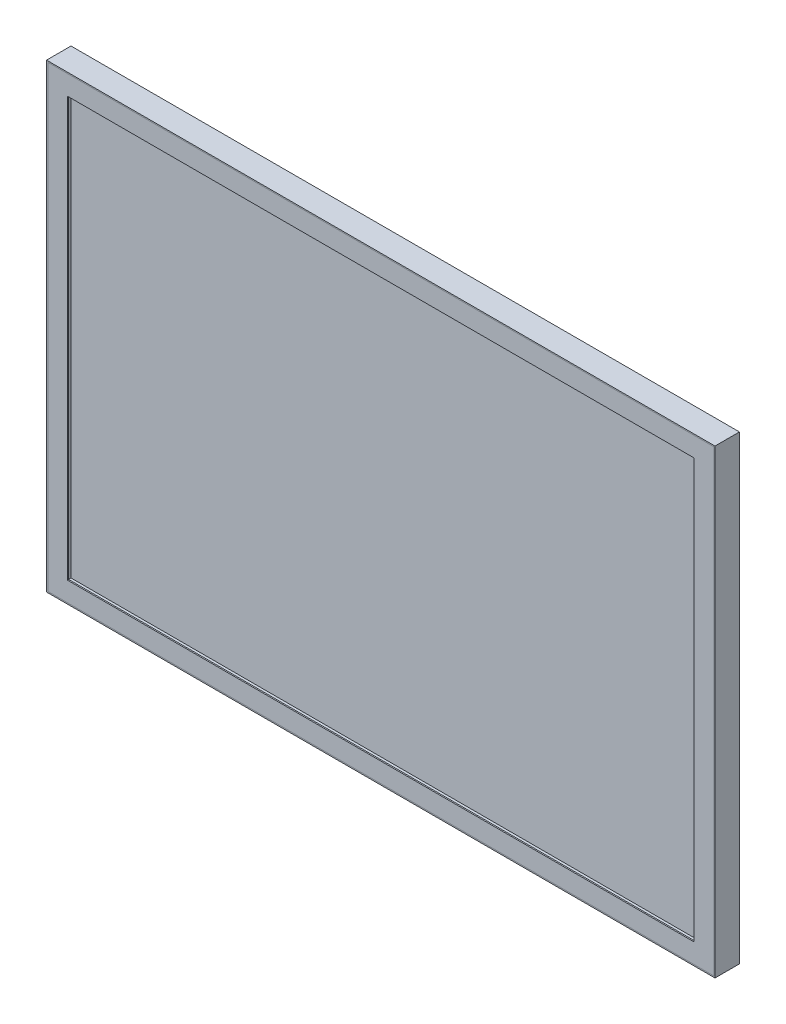
ISO-10303-21;
HEADER;
FILE_DESCRIPTION(('STEP AP214'),'2;1');
FILE_NAME('part.step','',(''),(''),'','','');
FILE_SCHEMA(('AUTOMOTIVE_DESIGN { 1 0 10303 214 1 1 1 1 }'));
ENDSEC;
DATA;
#1=APPLICATION_CONTEXT('core data for automotive mechanical design processes');
#2=APPLICATION_PROTOCOL_DEFINITION('international standard','automotive_design',2000,#1);
#3=PRODUCT_CONTEXT('',#1,'mechanical');
#4=PRODUCT('Part','Part','',(#3));
#5=PRODUCT_RELATED_PRODUCT_CATEGORY('part','',(#4));
#6=PRODUCT_DEFINITION_FORMATION('','',#4);
#7=PRODUCT_DEFINITION_CONTEXT('part definition',#1,'design');
#8=PRODUCT_DEFINITION('design','',#6,#7);
#9=PRODUCT_DEFINITION_SHAPE('','',#8);
#10=(LENGTH_UNIT() NAMED_UNIT(*) SI_UNIT(.MILLI.,.METRE.));
#11=(NAMED_UNIT(*) PLANE_ANGLE_UNIT() SI_UNIT($,.RADIAN.));
#12=(NAMED_UNIT(*) SI_UNIT($,.STERADIAN.) SOLID_ANGLE_UNIT());
#13=UNCERTAINTY_MEASURE_WITH_UNIT(LENGTH_MEASURE(1.E-05),#10,'distance_accuracy_value','');
#14=(GEOMETRIC_REPRESENTATION_CONTEXT(3) GLOBAL_UNCERTAINTY_ASSIGNED_CONTEXT((#13)) GLOBAL_UNIT_ASSIGNED_CONTEXT((#10,
#11,#12)) REPRESENTATION_CONTEXT('',''));
#15=CARTESIAN_POINT('',(0.,0.,0.));
#16=DIRECTION('',(0.,0.,1.));
#17=DIRECTION('',(1.,0.,0.));
#18=AXIS2_PLACEMENT_3D('',#15,#16,#17);
#19=CARTESIAN_POINT('',(-272.5,-187.5,19.));
#20=DIRECTION('',(0.,-1.,0.));
#21=DIRECTION('',(0.,0.,-1.));
#22=AXIS2_PLACEMENT_3D('',#19,#20,#21);
#23=PLANE('',#22);
#24=DIRECTION('',(1.,0.,0.));
#25=VECTOR('',#24,1.);
#26=CARTESIAN_POINT('',(-272.5,-187.5,20.));
#27=LINE('',#26,#25);
#28=CARTESIAN_POINT('',(-272.5,-187.5,20.));
#29=VERTEX_POINT('',#28);
#30=CARTESIAN_POINT('',(272.5,-187.5,20.));
#31=VERTEX_POINT('',#30);
#32=EDGE_CURVE('E147',#29,#31,#27,.T.);
#33=ORIENTED_EDGE('',*,*,#32,.F.);
#34=DIRECTION('',(0.,0.,1.));
#35=VECTOR('',#34,1.);
#36=CARTESIAN_POINT('',(-272.5,-187.5,19.));
#37=LINE('',#36,#35);
#38=CARTESIAN_POINT('',(-272.5,-187.5,19.));
#39=VERTEX_POINT('',#38);
#40=EDGE_CURVE('E12',#39,#29,#37,.T.);
#41=ORIENTED_EDGE('',*,*,#40,.F.);
#42=DIRECTION('',(1.,0.,0.));
#43=VECTOR('',#42,1.);
#44=CARTESIAN_POINT('',(-272.5,-187.5,19.));
#45=LINE('',#44,#43);
#46=CARTESIAN_POINT('',(272.5,-187.5,19.));
#47=VERTEX_POINT('',#46);
#48=EDGE_CURVE('E151',#39,#47,#45,.T.);
#49=ORIENTED_EDGE('',*,*,#48,.T.);
#50=DIRECTION('',(0.,0.,1.));
#51=VECTOR('',#50,1.);
#52=CARTESIAN_POINT('',(272.5,-187.5,19.));
#53=LINE('',#52,#51);
#54=EDGE_CURVE('E52',#47,#31,#53,.T.);
#55=ORIENTED_EDGE('',*,*,#54,.T.);
#56=EDGE_LOOP('',(#33,#41,#49,#55));
#57=FACE_BOUND('',#56,.T.);
#58=ADVANCED_FACE('F49',(#57),#23,.T.);
#59=CARTESIAN_POINT('',(-272.5,187.5,19.));
#60=DIRECTION('',(-1.,0.,0.));
#61=DIRECTION('',(0.,-1.,0.));
#62=AXIS2_PLACEMENT_3D('',#59,#60,#61);
#63=PLANE('',#62);
#64=DIRECTION('',(0.,-1.,0.));
#65=VECTOR('',#64,1.);
#66=CARTESIAN_POINT('',(-272.5,187.5,20.));
#67=LINE('',#66,#65);
#68=CARTESIAN_POINT('',(-272.5,187.5,20.));
#69=VERTEX_POINT('',#68);
#70=EDGE_CURVE('E155',#69,#29,#67,.T.);
#71=ORIENTED_EDGE('',*,*,#70,.F.);
#72=DIRECTION('',(0.,0.,1.));
#73=VECTOR('',#72,1.);
#74=CARTESIAN_POINT('',(-272.5,187.5,19.));
#75=LINE('',#74,#73);
#76=CARTESIAN_POINT('',(-272.5,187.5,19.));
#77=VERTEX_POINT('',#76);
#78=EDGE_CURVE('E57',#77,#69,#75,.T.);
#79=ORIENTED_EDGE('',*,*,#78,.F.);
#80=DIRECTION('',(0.,-1.,0.));
#81=VECTOR('',#80,1.);
#82=CARTESIAN_POINT('',(-272.5,187.5,19.));
#83=LINE('',#82,#81);
#84=EDGE_CURVE('E161',#77,#39,#83,.T.);
#85=ORIENTED_EDGE('',*,*,#84,.T.);
#86=ORIENTED_EDGE('',*,*,#40,.T.);
#87=EDGE_LOOP('',(#71,#79,#85,#86));
#88=FACE_BOUND('',#87,.T.);
#89=ADVANCED_FACE('F187',(#88),#63,.T.);
#90=CARTESIAN_POINT('',(272.5,187.5,19.));
#91=DIRECTION('',(0.,1.,0.));
#92=DIRECTION('',(0.,0.,1.));
#93=AXIS2_PLACEMENT_3D('',#90,#91,#92);
#94=PLANE('',#93);
#95=DIRECTION('',(-1.,0.,0.));
#96=VECTOR('',#95,1.);
#97=CARTESIAN_POINT('',(272.5,187.5,20.));
#98=LINE('',#97,#96);
#99=CARTESIAN_POINT('',(272.5,187.5,20.));
#100=VERTEX_POINT('',#99);
#101=EDGE_CURVE('E169',#100,#69,#98,.T.);
#102=ORIENTED_EDGE('',*,*,#101,.F.);
#103=DIRECTION('',(0.,0.,1.));
#104=VECTOR('',#103,1.);
#105=CARTESIAN_POINT('',(272.5,187.5,19.));
#106=LINE('',#105,#104);
#107=CARTESIAN_POINT('',(272.5,187.5,19.));
#108=VERTEX_POINT('',#107);
#109=EDGE_CURVE('E174',#108,#100,#106,.T.);
#110=ORIENTED_EDGE('',*,*,#109,.F.);
#111=DIRECTION('',(-1.,0.,0.));
#112=VECTOR('',#111,1.);
#113=CARTESIAN_POINT('',(272.5,187.5,19.));
#114=LINE('',#113,#112);
#115=EDGE_CURVE('E158',#108,#77,#114,.T.);
#116=ORIENTED_EDGE('',*,*,#115,.T.);
#117=ORIENTED_EDGE('',*,*,#78,.T.);
#118=EDGE_LOOP('',(#102,#110,#116,#117));
#119=FACE_BOUND('',#118,.T.);
#120=ADVANCED_FACE('F191',(#119),#94,.T.);
#121=CARTESIAN_POINT('',(272.5,-187.5,19.));
#122=DIRECTION('',(1.,0.,0.));
#123=DIRECTION('',(0.,1.,0.));
#124=AXIS2_PLACEMENT_3D('',#121,#122,#123);
#125=PLANE('',#124);
#126=DIRECTION('',(0.,1.,0.));
#127=VECTOR('',#126,1.);
#128=CARTESIAN_POINT('',(272.5,-187.5,20.));
#129=LINE('',#128,#127);
#130=EDGE_CURVE('E166',#31,#100,#129,.T.);
#131=ORIENTED_EDGE('',*,*,#130,.F.);
#132=ORIENTED_EDGE('',*,*,#54,.F.);
#133=DIRECTION('',(0.,1.,0.));
#134=VECTOR('',#133,1.);
#135=CARTESIAN_POINT('',(272.5,-187.5,19.));
#136=LINE('',#135,#134);
#137=EDGE_CURVE('E154',#47,#108,#136,.T.);
#138=ORIENTED_EDGE('',*,*,#137,.T.);
#139=ORIENTED_EDGE('',*,*,#109,.T.);
#140=EDGE_LOOP('',(#131,#132,#138,#139));
#141=FACE_BOUND('',#140,.T.);
#142=ADVANCED_FACE('F182',(#141),#125,.T.);
#143=CARTESIAN_POINT('',(0.,0.,19.));
#144=DIRECTION('',(0.,0.,1.));
#145=DIRECTION('',(1.,0.,0.));
#146=AXIS2_PLACEMENT_3D('',#143,#144,#145);
#147=PLANE('',#146);
#148=DIRECTION('',(0.,-1.,0.));
#149=VECTOR('',#148,1.);
#150=CARTESIAN_POINT('',(-256.5,171.5,19.));
#151=LINE('',#150,#149);
#152=CARTESIAN_POINT('',(-256.5,171.5,19.));
#153=VERTEX_POINT('',#152);
#154=CARTESIAN_POINT('',(-256.5,-171.5,19.));
#155=VERTEX_POINT('',#154);
#156=EDGE_CURVE('E122',#153,#155,#151,.T.);
#157=ORIENTED_EDGE('',*,*,#156,.T.);
#158=DIRECTION('',(1.,0.,0.));
#159=VECTOR('',#158,1.);
#160=CARTESIAN_POINT('',(-256.5,-171.5,19.));
#161=LINE('',#160,#159);
#162=CARTESIAN_POINT('',(256.5,-171.5,19.));
#163=VERTEX_POINT('',#162);
#164=EDGE_CURVE('E116',#155,#163,#161,.T.);
#165=ORIENTED_EDGE('',*,*,#164,.T.);
#166=DIRECTION('',(0.,1.,0.));
#167=VECTOR('',#166,1.);
#168=CARTESIAN_POINT('',(256.5,-171.5,19.));
#169=LINE('',#168,#167);
#170=CARTESIAN_POINT('',(256.5,171.5,19.));
#171=VERTEX_POINT('',#170);
#172=EDGE_CURVE('E125',#163,#171,#169,.T.);
#173=ORIENTED_EDGE('',*,*,#172,.T.);
#174=DIRECTION('',(-1.,0.,0.));
#175=VECTOR('',#174,1.);
#176=CARTESIAN_POINT('',(256.5,171.5,19.));
#177=LINE('',#176,#175);
#178=EDGE_CURVE('E65',#171,#153,#177,.T.);
#179=ORIENTED_EDGE('',*,*,#178,.T.);
#180=EDGE_LOOP('',(#157,#165,#173,#179));
#181=FACE_BOUND('',#180,.T.);
#182=ORIENTED_EDGE('',*,*,#48,.F.);
#183=ORIENTED_EDGE('',*,*,#84,.F.);
#184=ORIENTED_EDGE('',*,*,#115,.F.);
#185=ORIENTED_EDGE('',*,*,#137,.F.);
#186=EDGE_LOOP('',(#182,#183,#184,#185));
#187=FACE_BOUND('',#186,.T.);
#188=ADVANCED_FACE('F129',(#181,#187),#147,.F.);
#189=CARTESIAN_POINT('',(0.,0.,20.));
#190=DIRECTION('',(0.,0.,1.));
#191=DIRECTION('',(1.,0.,0.));
#192=AXIS2_PLACEMENT_3D('',#189,#190,#191);
#193=PLANE('',#192);
#194=DIRECTION('',(1.,0.,0.));
#195=VECTOR('',#194,1.);
#196=CARTESIAN_POINT('',(-256.5,-171.5,20.));
#197=LINE('',#196,#195);
#198=CARTESIAN_POINT('',(-256.5,-171.5,20.));
#199=VERTEX_POINT('',#198);
#200=CARTESIAN_POINT('',(256.5,-171.5,20.));
#201=VERTEX_POINT('',#200);
#202=EDGE_CURVE('E73',#199,#201,#197,.T.);
#203=ORIENTED_EDGE('',*,*,#202,.F.);
#204=DIRECTION('',(0.,-1.,0.));
#205=VECTOR('',#204,1.);
#206=CARTESIAN_POINT('',(-256.5,171.5,20.));
#207=LINE('',#206,#205);
#208=CARTESIAN_POINT('',(-256.5,171.5,20.));
#209=VERTEX_POINT('',#208);
#210=EDGE_CURVE('E132',#209,#199,#207,.T.);
#211=ORIENTED_EDGE('',*,*,#210,.F.);
#212=DIRECTION('',(-1.,0.,0.));
#213=VECTOR('',#212,1.);
#214=CARTESIAN_POINT('',(256.5,171.5,20.));
#215=LINE('',#214,#213);
#216=CARTESIAN_POINT('',(256.5,171.5,20.));
#217=VERTEX_POINT('',#216);
#218=EDGE_CURVE('E135',#217,#209,#215,.T.);
#219=ORIENTED_EDGE('',*,*,#218,.F.);
#220=DIRECTION('',(0.,1.,0.));
#221=VECTOR('',#220,1.);
#222=CARTESIAN_POINT('',(256.5,-171.5,20.));
#223=LINE('',#222,#221);
#224=EDGE_CURVE('E141',#201,#217,#223,.T.);
#225=ORIENTED_EDGE('',*,*,#224,.F.);
#226=EDGE_LOOP('',(#203,#211,#219,#225));
#227=FACE_BOUND('',#226,.T.);
#228=ORIENTED_EDGE('',*,*,#32,.T.);
#229=ORIENTED_EDGE('',*,*,#130,.T.);
#230=ORIENTED_EDGE('',*,*,#101,.T.);
#231=ORIENTED_EDGE('',*,*,#70,.T.);
#232=EDGE_LOOP('',(#228,#229,#230,#231));
#233=FACE_BOUND('',#232,.T.);
#234=ADVANCED_FACE('F184',(#227,#233),#193,.T.);
#235=CARTESIAN_POINT('',(-256.5,-171.5,19.));
#236=DIRECTION('',(0.,-1.,0.));
#237=DIRECTION('',(1.,0.,0.));
#238=AXIS2_PLACEMENT_3D('',#235,#236,#237);
#239=PLANE('',#238);
#240=ORIENTED_EDGE('',*,*,#202,.T.);
#241=DIRECTION('',(0.,0.,1.));
#242=VECTOR('',#241,1.);
#243=CARTESIAN_POINT('',(256.5,-171.5,19.));
#244=LINE('',#243,#242);
#245=EDGE_CURVE('E112',#163,#201,#244,.T.);
#246=ORIENTED_EDGE('',*,*,#245,.F.);
#247=ORIENTED_EDGE('',*,*,#164,.F.);
#248=DIRECTION('',(0.,0.,1.));
#249=VECTOR('',#248,1.);
#250=CARTESIAN_POINT('',(-256.5,-171.5,19.));
#251=LINE('',#250,#249);
#252=EDGE_CURVE('E145',#155,#199,#251,.T.);
#253=ORIENTED_EDGE('',*,*,#252,.T.);
#254=EDGE_LOOP('',(#240,#246,#247,#253));
#255=FACE_BOUND('',#254,.T.);
#256=ADVANCED_FACE('F114',(#255),#239,.F.);
#257=CARTESIAN_POINT('',(-256.5,171.5,19.));
#258=DIRECTION('',(-1.,0.,0.));
#259=DIRECTION('',(0.,-1.,0.));
#260=AXIS2_PLACEMENT_3D('',#257,#258,#259);
#261=PLANE('',#260);
#262=ORIENTED_EDGE('',*,*,#210,.T.);
#263=ORIENTED_EDGE('',*,*,#252,.F.);
#264=ORIENTED_EDGE('',*,*,#156,.F.);
#265=DIRECTION('',(0.,0.,1.));
#266=VECTOR('',#265,1.);
#267=CARTESIAN_POINT('',(-256.5,171.5,19.));
#268=LINE('',#267,#266);
#269=EDGE_CURVE('E148',#153,#209,#268,.T.);
#270=ORIENTED_EDGE('',*,*,#269,.T.);
#271=EDGE_LOOP('',(#262,#263,#264,#270));
#272=FACE_BOUND('',#271,.T.);
#273=ADVANCED_FACE('F242',(#272),#261,.F.);
#274=CARTESIAN_POINT('',(256.5,171.5,19.));
#275=DIRECTION('',(0.,1.,0.));
#276=DIRECTION('',(-1.,0.,0.));
#277=AXIS2_PLACEMENT_3D('',#274,#275,#276);
#278=PLANE('',#277);
#279=ORIENTED_EDGE('',*,*,#218,.T.);
#280=ORIENTED_EDGE('',*,*,#269,.F.);
#281=ORIENTED_EDGE('',*,*,#178,.F.);
#282=DIRECTION('',(0.,0.,1.));
#283=VECTOR('',#282,1.);
#284=CARTESIAN_POINT('',(256.5,171.5,19.));
#285=LINE('',#284,#283);
#286=EDGE_CURVE('E121',#171,#217,#285,.T.);
#287=ORIENTED_EDGE('',*,*,#286,.T.);
#288=EDGE_LOOP('',(#279,#280,#281,#287));
#289=FACE_BOUND('',#288,.T.);
#290=ADVANCED_FACE('F251',(#289),#278,.F.);
#291=CARTESIAN_POINT('',(256.5,-171.5,19.));
#292=DIRECTION('',(1.,0.,0.));
#293=DIRECTION('',(0.,0.,-1.));
#294=AXIS2_PLACEMENT_3D('',#291,#292,#293);
#295=PLANE('',#294);
#296=ORIENTED_EDGE('',*,*,#224,.T.);
#297=ORIENTED_EDGE('',*,*,#286,.F.);
#298=ORIENTED_EDGE('',*,*,#172,.F.);
#299=ORIENTED_EDGE('',*,*,#245,.T.);
#300=EDGE_LOOP('',(#296,#297,#298,#299));
#301=FACE_BOUND('',#300,.T.);
#302=ADVANCED_FACE('F126',(#301),#295,.F.);
#303=CLOSED_SHELL('',(#58,#89,#120,#142,#188,#234,#256,#273,#290,#302));
#304=MANIFOLD_SOLID_BREP('B2',#303);
#305=CARTESIAN_POINT('',(273.5,188.5,20.));
#306=DIRECTION('',(-1.,0.,0.));
#307=DIRECTION('',(0.,-1.,0.));
#308=AXIS2_PLACEMENT_3D('',#305,#306,#307);
#309=PLANE('',#308);
#310=DIRECTION('',(0.,1.,0.));
#311=VECTOR('',#310,1.);
#312=CARTESIAN_POINT('',(273.5,188.5,0.));
#313=LINE('',#312,#311);
#314=CARTESIAN_POINT('',(273.5,-188.5,0.));
#315=VERTEX_POINT('',#314);
#316=CARTESIAN_POINT('',(273.5,188.5,0.));
#317=VERTEX_POINT('',#316);
#318=EDGE_CURVE('E407',#315,#317,#313,.T.);
#319=ORIENTED_EDGE('',*,*,#318,.T.);
#320=DIRECTION('',(0.,0.,-1.));
#321=VECTOR('',#320,1.);
#322=CARTESIAN_POINT('',(273.5,188.5,20.));
#323=LINE('',#322,#321);
#324=CARTESIAN_POINT('',(273.5,188.5,20.));
#325=VERTEX_POINT('',#324);
#326=EDGE_CURVE('E47',#325,#317,#323,.T.);
#327=ORIENTED_EDGE('',*,*,#326,.F.);
#328=DIRECTION('',(0.,1.,0.));
#329=VECTOR('',#328,1.);
#330=CARTESIAN_POINT('',(273.5,188.5,20.));
#331=LINE('',#330,#329);
#332=CARTESIAN_POINT('',(273.5,-188.5,20.));
#333=VERTEX_POINT('',#332);
#334=EDGE_CURVE('E396',#333,#325,#331,.T.);
#335=ORIENTED_EDGE('',*,*,#334,.F.);
#336=DIRECTION('',(0.,0.,-1.));
#337=VECTOR('',#336,1.);
#338=CARTESIAN_POINT('',(273.5,-188.5,20.));
#339=LINE('',#338,#337);
#340=EDGE_CURVE('E406',#333,#315,#339,.T.);
#341=ORIENTED_EDGE('',*,*,#340,.T.);
#342=EDGE_LOOP('',(#319,#327,#335,#341));
#343=FACE_BOUND('',#342,.T.);
#344=ADVANCED_FACE('F279',(#343),#309,.F.);
#345=CARTESIAN_POINT('',(-273.5,188.5,20.));
#346=DIRECTION('',(0.,-1.,0.));
#347=DIRECTION('',(0.,0.,-1.));
#348=AXIS2_PLACEMENT_3D('',#345,#346,#347);
#349=PLANE('',#348);
#350=DIRECTION('',(-1.,0.,0.));
#351=VECTOR('',#350,1.);
#352=CARTESIAN_POINT('',(-273.5,188.5,0.));
#353=LINE('',#352,#351);
#354=CARTESIAN_POINT('',(-273.5,188.5,0.));
#355=VERTEX_POINT('',#354);
#356=EDGE_CURVE('E411',#317,#355,#353,.T.);
#357=ORIENTED_EDGE('',*,*,#356,.T.);
#358=DIRECTION('',(0.,0.,-1.));
#359=VECTOR('',#358,1.);
#360=CARTESIAN_POINT('',(-273.5,188.5,20.));
#361=LINE('',#360,#359);
#362=CARTESIAN_POINT('',(-273.5,188.5,20.));
#363=VERTEX_POINT('',#362);
#364=EDGE_CURVE('E287',#363,#355,#361,.T.);
#365=ORIENTED_EDGE('',*,*,#364,.F.);
#366=DIRECTION('',(-1.,0.,0.));
#367=VECTOR('',#366,1.);
#368=CARTESIAN_POINT('',(-273.5,188.5,20.));
#369=LINE('',#368,#367);
#370=EDGE_CURVE('E331',#325,#363,#369,.T.);
#371=ORIENTED_EDGE('',*,*,#370,.F.);
#372=ORIENTED_EDGE('',*,*,#326,.T.);
#373=EDGE_LOOP('',(#357,#365,#371,#372));
#374=FACE_BOUND('',#373,.T.);
#375=ADVANCED_FACE('F446',(#374),#349,.F.);
#376=CARTESIAN_POINT('',(-273.5,188.5,20.));
#377=DIRECTION('',(1.,0.,0.));
#378=DIRECTION('',(0.,1.,0.));
#379=AXIS2_PLACEMENT_3D('',#376,#377,#378);
#380=PLANE('',#379);
#381=DIRECTION('',(0.,-1.,0.));
#382=VECTOR('',#381,1.);
#383=CARTESIAN_POINT('',(-273.5,188.5,0.));
#384=LINE('',#383,#382);
#385=CARTESIAN_POINT('',(-273.5,-188.5,0.));
#386=VERTEX_POINT('',#385);
#387=EDGE_CURVE('E414',#355,#386,#384,.T.);
#388=ORIENTED_EDGE('',*,*,#387,.T.);
#389=DIRECTION('',(0.,0.,-1.));
#390=VECTOR('',#389,1.);
#391=CARTESIAN_POINT('',(-273.5,-188.5,20.));
#392=LINE('',#391,#390);
#393=CARTESIAN_POINT('',(-273.5,-188.5,20.));
#394=VERTEX_POINT('',#393);
#395=EDGE_CURVE('E421',#394,#386,#392,.T.);
#396=ORIENTED_EDGE('',*,*,#395,.F.);
#397=DIRECTION('',(0.,-1.,0.));
#398=VECTOR('',#397,1.);
#399=CARTESIAN_POINT('',(-273.5,188.5,20.));
#400=LINE('',#399,#398);
#401=EDGE_CURVE('E401',#363,#394,#400,.T.);
#402=ORIENTED_EDGE('',*,*,#401,.F.);
#403=ORIENTED_EDGE('',*,*,#364,.T.);
#404=EDGE_LOOP('',(#388,#396,#402,#403));
#405=FACE_BOUND('',#404,.T.);
#406=ADVANCED_FACE('F428',(#405),#380,.F.);
#407=CARTESIAN_POINT('',(-273.5,-188.5,20.));
#408=DIRECTION('',(0.,1.,0.));
#409=DIRECTION('',(0.,0.,1.));
#410=AXIS2_PLACEMENT_3D('',#407,#408,#409);
#411=PLANE('',#410);
#412=DIRECTION('',(1.,0.,0.));
#413=VECTOR('',#412,1.);
#414=CARTESIAN_POINT('',(-273.5,-188.5,0.));
#415=LINE('',#414,#413);
#416=EDGE_CURVE('E324',#386,#315,#415,.T.);
#417=ORIENTED_EDGE('',*,*,#416,.T.);
#418=ORIENTED_EDGE('',*,*,#340,.F.);
#419=DIRECTION('',(1.,0.,0.));
#420=VECTOR('',#419,1.);
#421=CARTESIAN_POINT('',(-273.5,-188.5,20.));
#422=LINE('',#421,#420);
#423=EDGE_CURVE('E303',#394,#333,#422,.T.);
#424=ORIENTED_EDGE('',*,*,#423,.F.);
#425=ORIENTED_EDGE('',*,*,#395,.T.);
#426=EDGE_LOOP('',(#417,#418,#424,#425));
#427=FACE_BOUND('',#426,.T.);
#428=ADVANCED_FACE('F436',(#427),#411,.F.);
#429=CARTESIAN_POINT('',(0.,0.,20.));
#430=DIRECTION('',(0.,0.,1.));
#431=DIRECTION('',(1.,0.,0.));
#432=AXIS2_PLACEMENT_3D('',#429,#430,#431);
#433=PLANE('',#432);
#434=DIRECTION('',(0.,1.,0.));
#435=VECTOR('',#434,1.);
#436=CARTESIAN_POINT('',(272.5,188.5,20.));
#437=LINE('',#436,#435);
#438=CARTESIAN_POINT('',(272.5,-187.5,20.));
#439=VERTEX_POINT('',#438);
#440=CARTESIAN_POINT('',(272.5,187.5,20.));
#441=VERTEX_POINT('',#440);
#442=EDGE_CURVE('E380',#439,#441,#437,.T.);
#443=ORIENTED_EDGE('',*,*,#442,.F.);
#444=DIRECTION('',(1.,0.,0.));
#445=VECTOR('',#444,1.);
#446=CARTESIAN_POINT('',(-273.5,-187.5,20.));
#447=LINE('',#446,#445);
#448=CARTESIAN_POINT('',(-272.5,-187.5,20.));
#449=VERTEX_POINT('',#448);
#450=EDGE_CURVE('E393',#449,#439,#447,.T.);
#451=ORIENTED_EDGE('',*,*,#450,.F.);
#452=DIRECTION('',(0.,-1.,0.));
#453=VECTOR('',#452,1.);
#454=CARTESIAN_POINT('',(-272.5,188.5,20.));
#455=LINE('',#454,#453);
#456=CARTESIAN_POINT('',(-272.5,187.5,20.));
#457=VERTEX_POINT('',#456);
#458=EDGE_CURVE('E390',#457,#449,#455,.T.);
#459=ORIENTED_EDGE('',*,*,#458,.F.);
#460=DIRECTION('',(-1.,0.,0.));
#461=VECTOR('',#460,1.);
#462=CARTESIAN_POINT('',(-273.5,187.5,20.));
#463=LINE('',#462,#461);
#464=EDGE_CURVE('E369',#441,#457,#463,.T.);
#465=ORIENTED_EDGE('',*,*,#464,.F.);
#466=EDGE_LOOP('',(#443,#451,#459,#465));
#467=FACE_BOUND('',#466,.T.);
#468=ORIENTED_EDGE('',*,*,#334,.T.);
#469=ORIENTED_EDGE('',*,*,#370,.T.);
#470=ORIENTED_EDGE('',*,*,#401,.T.);
#471=ORIENTED_EDGE('',*,*,#423,.T.);
#472=EDGE_LOOP('',(#468,#469,#470,#471));
#473=FACE_BOUND('',#472,.T.);
#474=ADVANCED_FACE('F438',(#467,#473),#433,.T.);
#475=CARTESIAN_POINT('',(0.,0.,0.));
#476=DIRECTION('',(0.,0.,1.));
#477=DIRECTION('',(1.,0.,0.));
#478=AXIS2_PLACEMENT_3D('',#475,#476,#477);
#479=PLANE('',#478);
#480=ORIENTED_EDGE('',*,*,#318,.F.);
#481=ORIENTED_EDGE('',*,*,#416,.F.);
#482=ORIENTED_EDGE('',*,*,#387,.F.);
#483=ORIENTED_EDGE('',*,*,#356,.F.);
#484=EDGE_LOOP('',(#480,#481,#482,#483));
#485=FACE_BOUND('',#484,.T.);
#486=ADVANCED_FACE('F432',(#485),#479,.F.);
#487=CARTESIAN_POINT('',(272.5,188.5,20.));
#488=DIRECTION('',(-1.,0.,0.));
#489=DIRECTION('',(0.,-1.,0.));
#490=AXIS2_PLACEMENT_3D('',#487,#488,#489);
#491=PLANE('',#490);
#492=DIRECTION('',(0.,1.,0.));
#493=VECTOR('',#492,1.);
#494=CARTESIAN_POINT('',(272.5,188.5,1.));
#495=LINE('',#494,#493);
#496=CARTESIAN_POINT('',(272.5,-187.5,1.));
#497=VERTEX_POINT('',#496);
#498=CARTESIAN_POINT('',(272.5,187.5,1.));
#499=VERTEX_POINT('',#498);
#500=EDGE_CURVE('E359',#497,#499,#495,.T.);
#501=ORIENTED_EDGE('',*,*,#500,.F.);
#502=DIRECTION('',(0.,0.,-1.));
#503=VECTOR('',#502,1.);
#504=CARTESIAN_POINT('',(272.5,-187.5,20.));
#505=LINE('',#504,#503);
#506=EDGE_CURVE('E384',#439,#497,#505,.T.);
#507=ORIENTED_EDGE('',*,*,#506,.F.);
#508=ORIENTED_EDGE('',*,*,#442,.T.);
#509=DIRECTION('',(0.,0.,-1.));
#510=VECTOR('',#509,1.);
#511=CARTESIAN_POINT('',(272.5,187.5,20.));
#512=LINE('',#511,#510);
#513=EDGE_CURVE('E373',#441,#499,#512,.T.);
#514=ORIENTED_EDGE('',*,*,#513,.T.);
#515=EDGE_LOOP('',(#501,#507,#508,#514));
#516=FACE_BOUND('',#515,.T.);
#517=ADVANCED_FACE('F473',(#516),#491,.T.);
#518=CARTESIAN_POINT('',(-273.5,187.5,20.));
#519=DIRECTION('',(0.,-1.,0.));
#520=DIRECTION('',(0.,0.,-1.));
#521=AXIS2_PLACEMENT_3D('',#518,#519,#520);
#522=PLANE('',#521);
#523=DIRECTION('',(-1.,0.,0.));
#524=VECTOR('',#523,1.);
#525=CARTESIAN_POINT('',(-273.5,187.5,1.));
#526=LINE('',#525,#524);
#527=CARTESIAN_POINT('',(-272.5,187.5,1.));
#528=VERTEX_POINT('',#527);
#529=EDGE_CURVE('E353',#499,#528,#526,.T.);
#530=ORIENTED_EDGE('',*,*,#529,.F.);
#531=ORIENTED_EDGE('',*,*,#513,.F.);
#532=ORIENTED_EDGE('',*,*,#464,.T.);
#533=DIRECTION('',(0.,0.,-1.));
#534=VECTOR('',#533,1.);
#535=CARTESIAN_POINT('',(-272.5,187.5,20.));
#536=LINE('',#535,#534);
#537=EDGE_CURVE('E366',#457,#528,#536,.T.);
#538=ORIENTED_EDGE('',*,*,#537,.T.);
#539=EDGE_LOOP('',(#530,#531,#532,#538));
#540=FACE_BOUND('',#539,.T.);
#541=ADVANCED_FACE('F367',(#540),#522,.T.);
#542=CARTESIAN_POINT('',(-272.5,188.5,20.));
#543=DIRECTION('',(1.,0.,0.));
#544=DIRECTION('',(0.,1.,0.));
#545=AXIS2_PLACEMENT_3D('',#542,#543,#544);
#546=PLANE('',#545);
#547=DIRECTION('',(0.,-1.,0.));
#548=VECTOR('',#547,1.);
#549=CARTESIAN_POINT('',(-272.5,188.5,1.));
#550=LINE('',#549,#548);
#551=CARTESIAN_POINT('',(-272.5,-187.5,1.));
#552=VERTEX_POINT('',#551);
#553=EDGE_CURVE('E357',#528,#552,#550,.T.);
#554=ORIENTED_EDGE('',*,*,#553,.F.);
#555=ORIENTED_EDGE('',*,*,#537,.F.);
#556=ORIENTED_EDGE('',*,*,#458,.T.);
#557=DIRECTION('',(0.,0.,-1.));
#558=VECTOR('',#557,1.);
#559=CARTESIAN_POINT('',(-272.5,-187.5,20.));
#560=LINE('',#559,#558);
#561=EDGE_CURVE('E294',#449,#552,#560,.T.);
#562=ORIENTED_EDGE('',*,*,#561,.T.);
#563=EDGE_LOOP('',(#554,#555,#556,#562));
#564=FACE_BOUND('',#563,.T.);
#565=ADVANCED_FACE('F375',(#564),#546,.T.);
#566=CARTESIAN_POINT('',(-273.5,-187.5,20.));
#567=DIRECTION('',(0.,1.,0.));
#568=DIRECTION('',(0.,0.,1.));
#569=AXIS2_PLACEMENT_3D('',#566,#567,#568);
#570=PLANE('',#569);
#571=DIRECTION('',(1.,0.,0.));
#572=VECTOR('',#571,1.);
#573=CARTESIAN_POINT('',(-273.5,-187.5,1.));
#574=LINE('',#573,#572);
#575=EDGE_CURVE('E377',#552,#497,#574,.T.);
#576=ORIENTED_EDGE('',*,*,#575,.F.);
#577=ORIENTED_EDGE('',*,*,#561,.F.);
#578=ORIENTED_EDGE('',*,*,#450,.T.);
#579=ORIENTED_EDGE('',*,*,#506,.T.);
#580=EDGE_LOOP('',(#576,#577,#578,#579));
#581=FACE_BOUND('',#580,.T.);
#582=ADVANCED_FACE('F503',(#581),#570,.T.);
#583=CARTESIAN_POINT('',(0.,0.,1.));
#584=DIRECTION('',(0.,0.,1.));
#585=DIRECTION('',(1.,0.,0.));
#586=AXIS2_PLACEMENT_3D('',#583,#584,#585);
#587=PLANE('',#586);
#588=ORIENTED_EDGE('',*,*,#500,.T.);
#589=ORIENTED_EDGE('',*,*,#529,.T.);
#590=ORIENTED_EDGE('',*,*,#553,.T.);
#591=ORIENTED_EDGE('',*,*,#575,.T.);
#592=EDGE_LOOP('',(#588,#589,#590,#591));
#593=FACE_BOUND('',#592,.T.);
#594=ADVANCED_FACE('F355',(#593),#587,.T.);
#595=CLOSED_SHELL('',(#344,#375,#406,#428,#474,#486,#517,#541,#565,#582,#594));
#596=MANIFOLD_SOLID_BREP('B6',#595);
#597=ADVANCED_BREP_SHAPE_REPRESENTATION('',(#18,#304,#596),#14);
#598=SHAPE_DEFINITION_REPRESENTATION(#9,#597);
ENDSEC;
END-ISO-10303-21;
